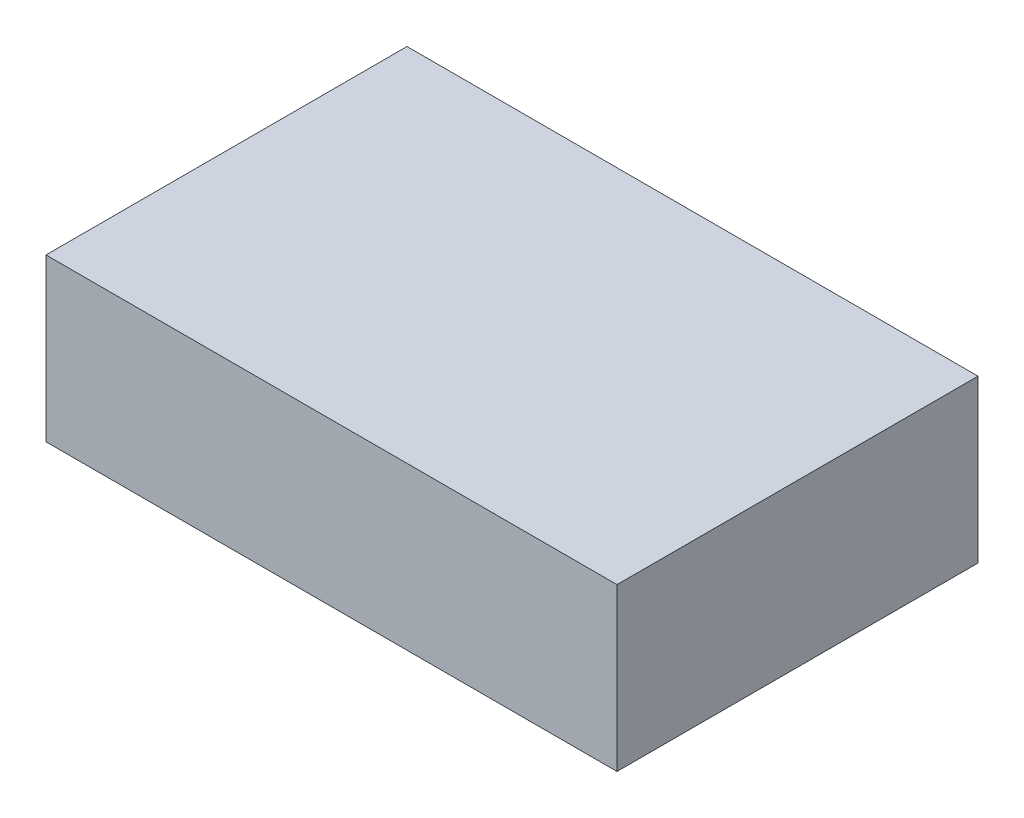
ISO-10303-21;
HEADER;
FILE_DESCRIPTION(('STEP AP214'),'2;1');
FILE_NAME('part.step','',(''),(''),'','','');
FILE_SCHEMA(('AUTOMOTIVE_DESIGN { 1 0 10303 214 1 1 1 1 }'));
ENDSEC;
DATA;
#1=APPLICATION_CONTEXT('core data for automotive mechanical design processes');
#2=APPLICATION_PROTOCOL_DEFINITION('international standard','automotive_design',2000,#1);
#3=PRODUCT_CONTEXT('',#1,'mechanical');
#4=PRODUCT('Part','Part','',(#3));
#5=PRODUCT_RELATED_PRODUCT_CATEGORY('part','',(#4));
#6=PRODUCT_DEFINITION_FORMATION('','',#4);
#7=PRODUCT_DEFINITION_CONTEXT('part definition',#1,'design');
#8=PRODUCT_DEFINITION('design','',#6,#7);
#9=PRODUCT_DEFINITION_SHAPE('','',#8);
#10=(LENGTH_UNIT() NAMED_UNIT(*) SI_UNIT(.MILLI.,.METRE.));
#11=(NAMED_UNIT(*) PLANE_ANGLE_UNIT() SI_UNIT($,.RADIAN.));
#12=(NAMED_UNIT(*) SI_UNIT($,.STERADIAN.) SOLID_ANGLE_UNIT());
#13=UNCERTAINTY_MEASURE_WITH_UNIT(LENGTH_MEASURE(1.E-05),#10,'distance_accuracy_value','');
#14=(GEOMETRIC_REPRESENTATION_CONTEXT(3) GLOBAL_UNCERTAINTY_ASSIGNED_CONTEXT((#13)) GLOBAL_UNIT_ASSIGNED_CONTEXT((#10,
#11,#12)) REPRESENTATION_CONTEXT('',''));
#15=CARTESIAN_POINT('',(0.,0.,0.));
#16=DIRECTION('',(0.,0.,1.));
#17=DIRECTION('',(1.,0.,0.));
#18=AXIS2_PLACEMENT_3D('',#15,#16,#17);
#19=CARTESIAN_POINT('',(-0.47448978,0.13449046,0.));
#20=DIRECTION('',(-2.67655206245712E-06,0.999999999996418,0.));
#21=DIRECTION('',(0.999999999996418,2.67655206245712E-06,0.));
#22=AXIS2_PLACEMENT_3D('',#19,#20,#21);
#23=PLANE('',#22);
#24=DIRECTION('',(0.,0.,1.));
#25=VECTOR('',#24,1.);
#26=CARTESIAN_POINT('',(-0.47448978,0.13449046,0.));
#27=LINE('',#26,#25);
#28=CARTESIAN_POINT('',(-0.47448978,0.13449046,0.));
#29=VERTEX_POINT('',#28);
#30=CARTESIAN_POINT('',(-0.47448978,0.13449046,0.5999988));
#31=VERTEX_POINT('',#30);
#32=EDGE_CURVE('E11',#29,#31,#27,.T.);
#33=ORIENTED_EDGE('',*,*,#32,.T.);
#34=DIRECTION('',(0.999999999996418,2.67655206245712E-06,0.));
#35=VECTOR('',#34,1.);
#36=CARTESIAN_POINT('',(-0.47448978,0.13449046,0.5999988));
#37=LINE('',#36,#35);
#38=CARTESIAN_POINT('',(0.47449232,0.134493,0.5999988));
#39=VERTEX_POINT('',#38);
#40=EDGE_CURVE('E23',#31,#39,#37,.T.);
#41=ORIENTED_EDGE('',*,*,#40,.T.);
#42=DIRECTION('',(0.,0.,1.));
#43=VECTOR('',#42,1.);
#44=CARTESIAN_POINT('',(0.47449232,0.134493,0.));
#45=LINE('',#44,#43);
#46=CARTESIAN_POINT('',(0.47449232,0.134493,0.));
#47=VERTEX_POINT('',#46);
#48=EDGE_CURVE('E84',#47,#39,#45,.T.);
#49=ORIENTED_EDGE('',*,*,#48,.F.);
#50=DIRECTION('',(0.999999999996418,2.67655206245712E-06,0.));
#51=VECTOR('',#50,1.);
#52=CARTESIAN_POINT('',(-0.47448978,0.13449046,0.));
#53=LINE('',#52,#51);
#54=EDGE_CURVE('E82',#29,#47,#53,.T.);
#55=ORIENTED_EDGE('',*,*,#54,.F.);
#56=EDGE_LOOP('',(#33,#41,#49,#55));
#57=FACE_BOUND('',#56,.T.);
#58=ADVANCED_FACE('F16',(#57),#23,.T.);
#59=CARTESIAN_POINT('',(0.47449232,0.134493,0.));
#60=DIRECTION('',(1.,0.,0.));
#61=DIRECTION('',(0.,-1.,0.));
#62=AXIS2_PLACEMENT_3D('',#59,#60,#61);
#63=PLANE('',#62);
#64=ORIENTED_EDGE('',*,*,#48,.T.);
#65=DIRECTION('',(0.,-1.,0.));
#66=VECTOR('',#65,1.);
#67=CARTESIAN_POINT('',(0.47449232,0.134493,0.5999988));
#68=LINE('',#67,#66);
#69=CARTESIAN_POINT('',(0.47449232,-0.13449046,0.5999988));
#70=VERTEX_POINT('',#69);
#71=EDGE_CURVE('E80',#39,#70,#68,.T.);
#72=ORIENTED_EDGE('',*,*,#71,.T.);
#73=DIRECTION('',(0.,0.,1.));
#74=VECTOR('',#73,1.);
#75=CARTESIAN_POINT('',(0.47449232,-0.13449046,0.));
#76=LINE('',#75,#74);
#77=CARTESIAN_POINT('',(0.47449232,-0.13449046,0.));
#78=VERTEX_POINT('',#77);
#79=EDGE_CURVE('E78',#78,#70,#76,.T.);
#80=ORIENTED_EDGE('',*,*,#79,.F.);
#81=DIRECTION('',(0.,-1.,0.));
#82=VECTOR('',#81,1.);
#83=CARTESIAN_POINT('',(0.47449232,0.134493,0.));
#84=LINE('',#83,#82);
#85=EDGE_CURVE('E69',#47,#78,#84,.T.);
#86=ORIENTED_EDGE('',*,*,#85,.F.);
#87=EDGE_LOOP('',(#64,#72,#80,#86));
#88=FACE_BOUND('',#87,.T.);
#89=ADVANCED_FACE('F89',(#88),#63,.T.);
#90=CARTESIAN_POINT('',(0.47449232,-0.13449046,0.));
#91=DIRECTION('',(0.,-1.,0.));
#92=DIRECTION('',(-1.,0.,0.));
#93=AXIS2_PLACEMENT_3D('',#90,#91,#92);
#94=PLANE('',#93);
#95=ORIENTED_EDGE('',*,*,#79,.T.);
#96=DIRECTION('',(-1.,0.,0.));
#97=VECTOR('',#96,1.);
#98=CARTESIAN_POINT('',(0.47449232,-0.13449046,0.5999988));
#99=LINE('',#98,#97);
#100=CARTESIAN_POINT('',(-0.47448724,-0.13449046,0.5999988));
#101=VERTEX_POINT('',#100);
#102=EDGE_CURVE('E59',#70,#101,#99,.T.);
#103=ORIENTED_EDGE('',*,*,#102,.T.);
#104=DIRECTION('',(0.,0.,1.));
#105=VECTOR('',#104,1.);
#106=CARTESIAN_POINT('',(-0.47448724,-0.13449046,0.));
#107=LINE('',#106,#105);
#108=CARTESIAN_POINT('',(-0.47448724,-0.13449046,0.));
#109=VERTEX_POINT('',#108);
#110=EDGE_CURVE('E53',#109,#101,#107,.T.);
#111=ORIENTED_EDGE('',*,*,#110,.F.);
#112=DIRECTION('',(-1.,0.,0.));
#113=VECTOR('',#112,1.);
#114=CARTESIAN_POINT('',(0.47449232,-0.13449046,0.));
#115=LINE('',#114,#113);
#116=EDGE_CURVE('E57',#78,#109,#115,.T.);
#117=ORIENTED_EDGE('',*,*,#116,.F.);
#118=EDGE_LOOP('',(#95,#103,#111,#117));
#119=FACE_BOUND('',#118,.T.);
#120=ADVANCED_FACE('F56',(#119),#94,.T.);
#121=CARTESIAN_POINT('',(-0.47448724,-0.13449046,0.));
#122=DIRECTION('',(-0.999999999955414,-9.44304896007291E-06,0.));
#123=DIRECTION('',(-9.44304896007291E-06,0.999999999955414,0.));
#124=AXIS2_PLACEMENT_3D('',#121,#122,#123);
#125=PLANE('',#124);
#126=ORIENTED_EDGE('',*,*,#110,.T.);
#127=DIRECTION('',(-9.44304896007291E-06,0.999999999955414,0.));
#128=VECTOR('',#127,1.);
#129=CARTESIAN_POINT('',(-0.47448724,-0.13449046,0.5999988));
#130=LINE('',#129,#128);
#131=EDGE_CURVE('E70',#101,#31,#130,.T.);
#132=ORIENTED_EDGE('',*,*,#131,.T.);
#133=ORIENTED_EDGE('',*,*,#32,.F.);
#134=DIRECTION('',(-9.44304896007291E-06,0.999999999955414,0.));
#135=VECTOR('',#134,1.);
#136=CARTESIAN_POINT('',(-0.47448724,-0.13449046,0.));
#137=LINE('',#136,#135);
#138=EDGE_CURVE('E67',#109,#29,#137,.T.);
#139=ORIENTED_EDGE('',*,*,#138,.F.);
#140=EDGE_LOOP('',(#126,#132,#133,#139));
#141=FACE_BOUND('',#140,.T.);
#142=ADVANCED_FACE('F72',(#141),#125,.T.);
#143=CARTESIAN_POINT('',(-0.47448978,0.13449046,0.));
#144=DIRECTION('',(0.,0.,1.));
#145=DIRECTION('',(1.,0.,0.));
#146=AXIS2_PLACEMENT_3D('',#143,#144,#145);
#147=PLANE('',#146);
#148=ORIENTED_EDGE('',*,*,#54,.T.);
#149=ORIENTED_EDGE('',*,*,#85,.T.);
#150=ORIENTED_EDGE('',*,*,#116,.T.);
#151=ORIENTED_EDGE('',*,*,#138,.T.);
#152=EDGE_LOOP('',(#148,#149,#150,#151));
#153=FACE_BOUND('',#152,.T.);
#154=ADVANCED_FACE('F66',(#153),#147,.F.);
#155=CARTESIAN_POINT('',(-0.47448978,0.13449046,0.5999988));
#156=DIRECTION('',(0.,0.,1.));
#157=DIRECTION('',(1.,0.,0.));
#158=AXIS2_PLACEMENT_3D('',#155,#156,#157);
#159=PLANE('',#158);
#160=ORIENTED_EDGE('',*,*,#131,.F.);
#161=ORIENTED_EDGE('',*,*,#102,.F.);
#162=ORIENTED_EDGE('',*,*,#71,.F.);
#163=ORIENTED_EDGE('',*,*,#40,.F.);
#164=EDGE_LOOP('',(#160,#161,#162,#163));
#165=FACE_BOUND('',#164,.T.);
#166=ADVANCED_FACE('F90',(#165),#159,.T.);
#167=CLOSED_SHELL('',(#58,#89,#120,#142,#154,#166));
#168=MANIFOLD_SOLID_BREP('B1',#167);
#169=ADVANCED_BREP_SHAPE_REPRESENTATION('',(#18,#168),#14);
#170=SHAPE_DEFINITION_REPRESENTATION(#9,#169);
ENDSEC;
END-ISO-10303-21;
